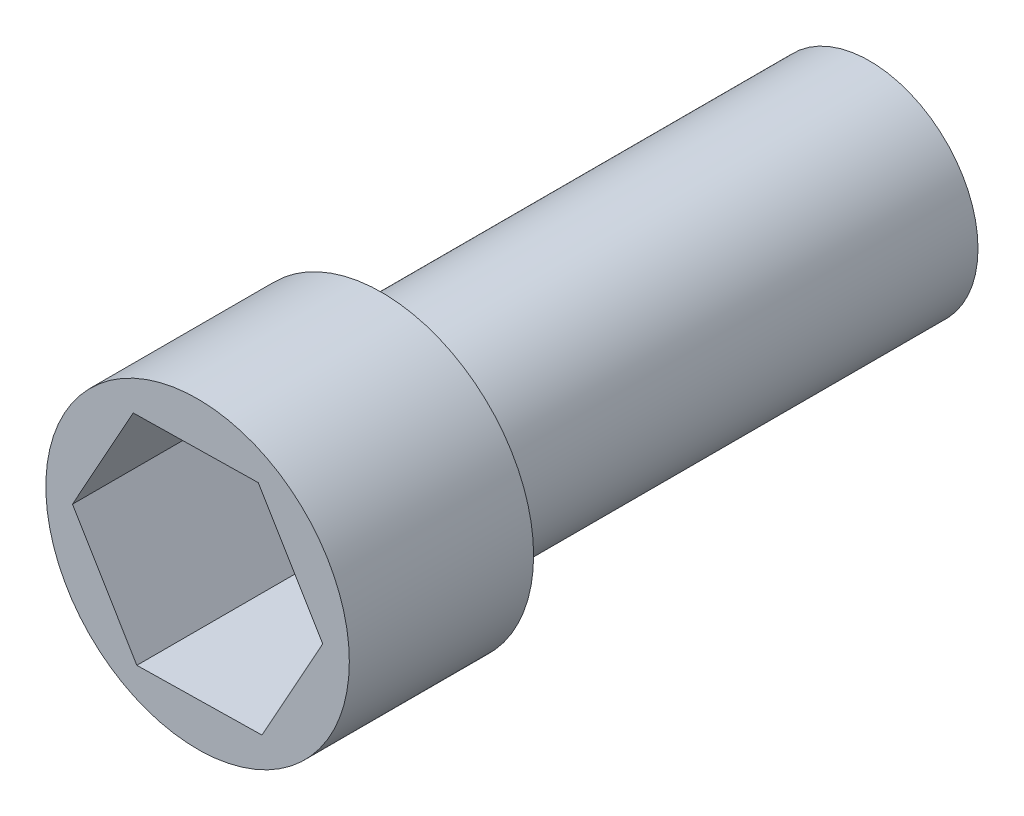
ISO-10303-21;
HEADER;
FILE_DESCRIPTION(('STEP AP214'),'2;1');
FILE_NAME('part.step','',(''),(''),'','','');
FILE_SCHEMA(('AUTOMOTIVE_DESIGN { 1 0 10303 214 1 1 1 1 }'));
ENDSEC;
DATA;
#1=APPLICATION_CONTEXT('core data for automotive mechanical design processes');
#2=APPLICATION_PROTOCOL_DEFINITION('international standard','automotive_design',2000,#1);
#3=PRODUCT_CONTEXT('',#1,'mechanical');
#4=PRODUCT('Part','Part','',(#3));
#5=PRODUCT_RELATED_PRODUCT_CATEGORY('part','',(#4));
#6=PRODUCT_DEFINITION_FORMATION('','',#4);
#7=PRODUCT_DEFINITION_CONTEXT('part definition',#1,'design');
#8=PRODUCT_DEFINITION('design','',#6,#7);
#9=PRODUCT_DEFINITION_SHAPE('','',#8);
#10=(LENGTH_UNIT() NAMED_UNIT(*) SI_UNIT(.MILLI.,.METRE.));
#11=(NAMED_UNIT(*) PLANE_ANGLE_UNIT() SI_UNIT($,.RADIAN.));
#12=(NAMED_UNIT(*) SI_UNIT($,.STERADIAN.) SOLID_ANGLE_UNIT());
#13=UNCERTAINTY_MEASURE_WITH_UNIT(LENGTH_MEASURE(1.E-05),#10,'distance_accuracy_value','');
#14=(GEOMETRIC_REPRESENTATION_CONTEXT(3) GLOBAL_UNCERTAINTY_ASSIGNED_CONTEXT((#13)) GLOBAL_UNIT_ASSIGNED_CONTEXT((#10,
#11,#12)) REPRESENTATION_CONTEXT('',''));
#15=CARTESIAN_POINT('',(0.,0.,0.));
#16=DIRECTION('',(0.,0.,1.));
#17=DIRECTION('',(1.,0.,0.));
#18=AXIS2_PLACEMENT_3D('',#15,#16,#17);
#19=CARTESIAN_POINT('',(0.,0.,-17.));
#20=DIRECTION('',(0.,0.,1.));
#21=DIRECTION('',(1.,0.,0.));
#22=AXIS2_PLACEMENT_3D('',#19,#20,#21);
#23=CYLINDRICAL_SURFACE('',#22,14.);
#24=CARTESIAN_POINT('',(0.,0.,-17.));
#25=DIRECTION('',(0.,0.,1.));
#26=DIRECTION('',(1.,0.,0.));
#27=AXIS2_PLACEMENT_3D('',#24,#25,#26);
#28=CIRCLE('',#27,14.);
#29=CARTESIAN_POINT('',(14.,0.,-17.));
#30=VERTEX_POINT('',#29);
#31=EDGE_CURVE('E45',#30,#30,#28,.T.);
#32=ORIENTED_EDGE('',*,*,#31,.T.);
#33=EDGE_LOOP('',(#32));
#34=FACE_BOUND('',#33,.T.);
#35=CARTESIAN_POINT('',(0.,0.,0.));
#36=DIRECTION('',(0.,0.,1.));
#37=DIRECTION('',(1.,0.,0.));
#38=AXIS2_PLACEMENT_3D('',#35,#36,#37);
#39=CIRCLE('',#38,14.);
#40=CARTESIAN_POINT('',(14.,0.,0.));
#41=VERTEX_POINT('',#40);
#42=EDGE_CURVE('E40',#41,#41,#39,.T.);
#43=ORIENTED_EDGE('',*,*,#42,.F.);
#44=EDGE_LOOP('',(#43));
#45=FACE_BOUND('',#44,.T.);
#46=ADVANCED_FACE('F37',(#34,#45),#23,.T.);
#47=CARTESIAN_POINT('',(0.,0.,-17.));
#48=DIRECTION('',(0.,0.,1.));
#49=DIRECTION('',(1.,0.,0.));
#50=AXIS2_PLACEMENT_3D('',#47,#48,#49);
#51=PLANE('',#50);
#52=CARTESIAN_POINT('',(0.,0.,-17.));
#53=DIRECTION('',(0.,0.,-1.));
#54=DIRECTION('',(-1.,0.,0.));
#55=AXIS2_PLACEMENT_3D('',#52,#53,#54);
#56=CIRCLE('',#55,10.);
#57=CARTESIAN_POINT('',(-10.,0.,-17.));
#58=VERTEX_POINT('',#57);
#59=EDGE_CURVE('E11',#58,#58,#56,.T.);
#60=ORIENTED_EDGE('',*,*,#59,.F.);
#61=EDGE_LOOP('',(#60));
#62=FACE_BOUND('',#61,.T.);
#63=ORIENTED_EDGE('',*,*,#31,.F.);
#64=EDGE_LOOP('',(#63));
#65=FACE_BOUND('',#64,.T.);
#66=ADVANCED_FACE('F156',(#62,#65),#51,.F.);
#67=CARTESIAN_POINT('',(0.,0.,0.));
#68=DIRECTION('',(0.,0.,1.));
#69=DIRECTION('',(1.,0.,0.));
#70=AXIS2_PLACEMENT_3D('',#67,#68,#69);
#71=PLANE('',#70);
#72=DIRECTION('',(-0.514761437563776,0.857333460444228,0.));
#73=VECTOR('',#72,1.);
#74=CARTESIAN_POINT('',(11.5453111499011,0.197797333910281,0.));
#75=LINE('',#74,#73);
#76=CARTESIAN_POINT('',(11.5453111499011,0.197797333910281,0.));
#77=VERTEX_POINT('',#76);
#78=CARTESIAN_POINT('',(5.60135805898343,10.0974314173652,0.));
#79=VERTEX_POINT('',#78);
#80=EDGE_CURVE('E53',#77,#79,#75,.T.);
#81=ORIENTED_EDGE('',*,*,#80,.F.);
#82=DIRECTION('',(0.485091837477235,0.874463212040941,0.));
#83=VECTOR('',#82,1.);
#84=CARTESIAN_POINT('',(5.9439530909177,-9.89963408345497,0.));
#85=LINE('',#84,#83);
#86=CARTESIAN_POINT('',(5.9439530909177,-9.89963408345497,0.));
#87=VERTEX_POINT('',#86);
#88=EDGE_CURVE('E136',#87,#77,#85,.T.);
#89=ORIENTED_EDGE('',*,*,#88,.F.);
#90=DIRECTION('',(0.999853275041011,0.0171297515967135,0.));
#91=VECTOR('',#90,1.);
#92=CARTESIAN_POINT('',(-5.60135805898343,-10.0974314173652,0.));
#93=LINE('',#92,#91);
#94=CARTESIAN_POINT('',(-5.60135805898343,-10.0974314173652,0.));
#95=VERTEX_POINT('',#94);
#96=EDGE_CURVE('E134',#95,#87,#93,.T.);
#97=ORIENTED_EDGE('',*,*,#96,.F.);
#98=DIRECTION('',(0.514761437563776,-0.857333460444228,0.));
#99=VECTOR('',#98,1.);
#100=CARTESIAN_POINT('',(-11.5453111499011,-0.197797333910277,0.));
#101=LINE('',#100,#99);
#102=CARTESIAN_POINT('',(-11.5453111499011,-0.197797333910277,0.));
#103=VERTEX_POINT('',#102);
#104=EDGE_CURVE('E101',#103,#95,#101,.T.);
#105=ORIENTED_EDGE('',*,*,#104,.F.);
#106=DIRECTION('',(-0.485091837477234,-0.874463212040941,0.));
#107=VECTOR('',#106,1.);
#108=CARTESIAN_POINT('',(-5.9439530909177,9.89963408345497,0.));
#109=LINE('',#108,#107);
#110=CARTESIAN_POINT('',(-5.9439530909177,9.89963408345497,0.));
#111=VERTEX_POINT('',#110);
#112=EDGE_CURVE('E130',#111,#103,#109,.T.);
#113=ORIENTED_EDGE('',*,*,#112,.F.);
#114=DIRECTION('',(-0.999853275041011,-0.0171297515967133,0.));
#115=VECTOR('',#114,1.);
#116=CARTESIAN_POINT('',(5.60135805898343,10.0974314173652,0.));
#117=LINE('',#116,#115);
#118=EDGE_CURVE('E127',#79,#111,#117,.T.);
#119=ORIENTED_EDGE('',*,*,#118,.F.);
#120=EDGE_LOOP('',(#81,#89,#97,#105,#113,#119));
#121=FACE_BOUND('',#120,.T.);
#122=ORIENTED_EDGE('',*,*,#42,.T.);
#123=EDGE_LOOP('',(#122));
#124=FACE_BOUND('',#123,.T.);
#125=ADVANCED_FACE('F153',(#121,#124),#71,.T.);
#126=CARTESIAN_POINT('',(0.,0.,-62.));
#127=DIRECTION('',(0.,0.,1.));
#128=DIRECTION('',(1.,0.,0.));
#129=AXIS2_PLACEMENT_3D('',#126,#127,#128);
#130=CYLINDRICAL_SURFACE('',#129,10.);
#131=CARTESIAN_POINT('',(0.,0.,-62.));
#132=DIRECTION('',(0.,0.,-1.));
#133=DIRECTION('',(-1.,0.,0.));
#134=AXIS2_PLACEMENT_3D('',#131,#132,#133);
#135=CIRCLE('',#134,10.);
#136=CARTESIAN_POINT('',(-10.,0.,-62.));
#137=VERTEX_POINT('',#136);
#138=EDGE_CURVE('E140',#137,#137,#135,.T.);
#139=ORIENTED_EDGE('',*,*,#138,.F.);
#140=EDGE_LOOP('',(#139));
#141=FACE_BOUND('',#140,.T.);
#142=ORIENTED_EDGE('',*,*,#59,.T.);
#143=EDGE_LOOP('',(#142));
#144=FACE_BOUND('',#143,.T.);
#145=ADVANCED_FACE('F165',(#141,#144),#130,.T.);
#146=CARTESIAN_POINT('',(0.,0.,-62.));
#147=DIRECTION('',(0.,0.,-1.));
#148=DIRECTION('',(-1.,0.,0.));
#149=AXIS2_PLACEMENT_3D('',#146,#147,#148);
#150=PLANE('',#149);
#151=ORIENTED_EDGE('',*,*,#138,.T.);
#152=EDGE_LOOP('',(#151));
#153=FACE_BOUND('',#152,.T.);
#154=ADVANCED_FACE('F172',(#153),#150,.T.);
#155=CARTESIAN_POINT('',(11.5453111499011,0.197797333910281,-16.));
#156=DIRECTION('',(0.857333460444228,0.514761437563776,0.));
#157=DIRECTION('',(-0.514761437563776,0.857333460444228,0.));
#158=AXIS2_PLACEMENT_3D('',#155,#156,#157);
#159=PLANE('',#158);
#160=ORIENTED_EDGE('',*,*,#80,.T.);
#161=DIRECTION('',(0.,0.,1.));
#162=VECTOR('',#161,1.);
#163=CARTESIAN_POINT('',(5.60135805898343,10.0974314173652,-16.));
#164=LINE('',#163,#162);
#165=CARTESIAN_POINT('',(5.60135805898343,10.0974314173652,-16.));
#166=VERTEX_POINT('',#165);
#167=EDGE_CURVE('E83',#166,#79,#164,.T.);
#168=ORIENTED_EDGE('',*,*,#167,.F.);
#169=DIRECTION('',(-0.514761437563776,0.857333460444228,0.));
#170=VECTOR('',#169,1.);
#171=CARTESIAN_POINT('',(11.5453111499011,0.197797333910281,-16.));
#172=LINE('',#171,#170);
#173=CARTESIAN_POINT('',(11.5453111499011,0.197797333910281,-16.));
#174=VERTEX_POINT('',#173);
#175=EDGE_CURVE('E138',#174,#166,#172,.T.);
#176=ORIENTED_EDGE('',*,*,#175,.F.);
#177=DIRECTION('',(0.,0.,1.));
#178=VECTOR('',#177,1.);
#179=CARTESIAN_POINT('',(11.5453111499011,0.197797333910281,-16.));
#180=LINE('',#179,#178);
#181=EDGE_CURVE('E61',#174,#77,#180,.T.);
#182=ORIENTED_EDGE('',*,*,#181,.T.);
#183=EDGE_LOOP('',(#160,#168,#176,#182));
#184=FACE_BOUND('',#183,.T.);
#185=ADVANCED_FACE('F176',(#184),#159,.F.);
#186=CARTESIAN_POINT('',(5.9439530909177,-9.89963408345497,-16.));
#187=DIRECTION('',(0.874463212040941,-0.485091837477235,0.));
#188=DIRECTION('',(0.485091837477235,0.874463212040941,0.));
#189=AXIS2_PLACEMENT_3D('',#186,#187,#188);
#190=PLANE('',#189);
#191=ORIENTED_EDGE('',*,*,#88,.T.);
#192=ORIENTED_EDGE('',*,*,#181,.F.);
#193=DIRECTION('',(0.485091837477235,0.874463212040941,0.));
#194=VECTOR('',#193,1.);
#195=CARTESIAN_POINT('',(5.9439530909177,-9.89963408345497,-16.));
#196=LINE('',#195,#194);
#197=CARTESIAN_POINT('',(5.9439530909177,-9.89963408345497,-16.));
#198=VERTEX_POINT('',#197);
#199=EDGE_CURVE('E113',#198,#174,#196,.T.);
#200=ORIENTED_EDGE('',*,*,#199,.F.);
#201=DIRECTION('',(0.,0.,1.));
#202=VECTOR('',#201,1.);
#203=CARTESIAN_POINT('',(5.9439530909177,-9.89963408345497,-16.));
#204=LINE('',#203,#202);
#205=EDGE_CURVE('E105',#198,#87,#204,.T.);
#206=ORIENTED_EDGE('',*,*,#205,.T.);
#207=EDGE_LOOP('',(#191,#192,#200,#206));
#208=FACE_BOUND('',#207,.T.);
#209=ADVANCED_FACE('F180',(#208),#190,.F.);
#210=CARTESIAN_POINT('',(-5.60135805898343,-10.0974314173652,-16.));
#211=DIRECTION('',(0.0171297515967135,-0.999853275041011,0.));
#212=DIRECTION('',(0.999853275041011,0.0171297515967135,0.));
#213=AXIS2_PLACEMENT_3D('',#210,#211,#212);
#214=PLANE('',#213);
#215=ORIENTED_EDGE('',*,*,#96,.T.);
#216=ORIENTED_EDGE('',*,*,#205,.F.);
#217=DIRECTION('',(0.999853275041011,0.0171297515967135,0.));
#218=VECTOR('',#217,1.);
#219=CARTESIAN_POINT('',(-5.60135805898343,-10.0974314173652,-16.));
#220=LINE('',#219,#218);
#221=CARTESIAN_POINT('',(-5.60135805898343,-10.0974314173652,-16.));
#222=VERTEX_POINT('',#221);
#223=EDGE_CURVE('E109',#222,#198,#220,.T.);
#224=ORIENTED_EDGE('',*,*,#223,.F.);
#225=DIRECTION('',(0.,0.,1.));
#226=VECTOR('',#225,1.);
#227=CARTESIAN_POINT('',(-5.60135805898343,-10.0974314173652,-16.));
#228=LINE('',#227,#226);
#229=EDGE_CURVE('E94',#222,#95,#228,.T.);
#230=ORIENTED_EDGE('',*,*,#229,.T.);
#231=EDGE_LOOP('',(#215,#216,#224,#230));
#232=FACE_BOUND('',#231,.T.);
#233=ADVANCED_FACE('F110',(#232),#214,.F.);
#234=CARTESIAN_POINT('',(-11.5453111499011,-0.197797333910277,-16.));
#235=DIRECTION('',(-0.857333460444228,-0.514761437563776,0.));
#236=DIRECTION('',(0.514761437563776,-0.857333460444228,0.));
#237=AXIS2_PLACEMENT_3D('',#234,#235,#236);
#238=PLANE('',#237);
#239=ORIENTED_EDGE('',*,*,#104,.T.);
#240=ORIENTED_EDGE('',*,*,#229,.F.);
#241=DIRECTION('',(0.514761437563776,-0.857333460444228,0.));
#242=VECTOR('',#241,1.);
#243=CARTESIAN_POINT('',(-11.5453111499011,-0.197797333910277,-16.));
#244=LINE('',#243,#242);
#245=CARTESIAN_POINT('',(-11.5453111499011,-0.197797333910277,-16.));
#246=VERTEX_POINT('',#245);
#247=EDGE_CURVE('E98',#246,#222,#244,.T.);
#248=ORIENTED_EDGE('',*,*,#247,.F.);
#249=DIRECTION('',(0.,0.,1.));
#250=VECTOR('',#249,1.);
#251=CARTESIAN_POINT('',(-11.5453111499011,-0.197797333910277,-16.));
#252=LINE('',#251,#250);
#253=EDGE_CURVE('E106',#246,#103,#252,.T.);
#254=ORIENTED_EDGE('',*,*,#253,.T.);
#255=EDGE_LOOP('',(#239,#240,#248,#254));
#256=FACE_BOUND('',#255,.T.);
#257=ADVANCED_FACE('F96',(#256),#238,.F.);
#258=CARTESIAN_POINT('',(-5.9439530909177,9.89963408345497,-16.));
#259=DIRECTION('',(-0.874463212040941,0.485091837477234,0.));
#260=DIRECTION('',(-0.485091837477234,-0.874463212040941,0.));
#261=AXIS2_PLACEMENT_3D('',#258,#259,#260);
#262=PLANE('',#261);
#263=ORIENTED_EDGE('',*,*,#112,.T.);
#264=ORIENTED_EDGE('',*,*,#253,.F.);
#265=DIRECTION('',(-0.485091837477234,-0.874463212040941,0.));
#266=VECTOR('',#265,1.);
#267=CARTESIAN_POINT('',(-5.9439530909177,9.89963408345497,-16.));
#268=LINE('',#267,#266);
#269=CARTESIAN_POINT('',(-5.9439530909177,9.89963408345497,-16.));
#270=VERTEX_POINT('',#269);
#271=EDGE_CURVE('E119',#270,#246,#268,.T.);
#272=ORIENTED_EDGE('',*,*,#271,.F.);
#273=DIRECTION('',(0.,0.,1.));
#274=VECTOR('',#273,1.);
#275=CARTESIAN_POINT('',(-5.9439530909177,9.89963408345497,-16.));
#276=LINE('',#275,#274);
#277=EDGE_CURVE('E143',#270,#111,#276,.T.);
#278=ORIENTED_EDGE('',*,*,#277,.T.);
#279=EDGE_LOOP('',(#263,#264,#272,#278));
#280=FACE_BOUND('',#279,.T.);
#281=ADVANCED_FACE('F184',(#280),#262,.F.);
#282=CARTESIAN_POINT('',(5.60135805898343,10.0974314173652,-16.));
#283=DIRECTION('',(-0.0171297515967134,0.999853275041011,0.));
#284=DIRECTION('',(-0.999853275041011,-0.0171297515967133,0.));
#285=AXIS2_PLACEMENT_3D('',#282,#283,#284);
#286=PLANE('',#285);
#287=ORIENTED_EDGE('',*,*,#118,.T.);
#288=ORIENTED_EDGE('',*,*,#277,.F.);
#289=DIRECTION('',(-0.999853275041011,-0.0171297515967133,0.));
#290=VECTOR('',#289,1.);
#291=CARTESIAN_POINT('',(5.60135805898343,10.0974314173652,-16.));
#292=LINE('',#291,#290);
#293=EDGE_CURVE('E121',#166,#270,#292,.T.);
#294=ORIENTED_EDGE('',*,*,#293,.F.);
#295=ORIENTED_EDGE('',*,*,#167,.T.);
#296=EDGE_LOOP('',(#287,#288,#294,#295));
#297=FACE_BOUND('',#296,.T.);
#298=ADVANCED_FACE('F181',(#297),#286,.F.);
#299=CARTESIAN_POINT('',(0.,0.,-16.));
#300=DIRECTION('',(0.,0.,1.));
#301=DIRECTION('',(1.,0.,0.));
#302=AXIS2_PLACEMENT_3D('',#299,#300,#301);
#303=PLANE('',#302);
#304=ORIENTED_EDGE('',*,*,#175,.T.);
#305=ORIENTED_EDGE('',*,*,#293,.T.);
#306=ORIENTED_EDGE('',*,*,#271,.T.);
#307=ORIENTED_EDGE('',*,*,#247,.T.);
#308=ORIENTED_EDGE('',*,*,#223,.T.);
#309=ORIENTED_EDGE('',*,*,#199,.T.);
#310=EDGE_LOOP('',(#304,#305,#306,#307,#308,#309));
#311=FACE_BOUND('',#310,.T.);
#312=ADVANCED_FACE('F116',(#311),#303,.T.);
#313=CLOSED_SHELL('',(#46,#66,#125,#145,#154,#185,#209,#233,#257,#281,#298,#312));
#314=MANIFOLD_SOLID_BREP('B2',#313);
#315=ADVANCED_BREP_SHAPE_REPRESENTATION('',(#18,#314),#14);
#316=SHAPE_DEFINITION_REPRESENTATION(#9,#315);
ENDSEC;
END-ISO-10303-21;
